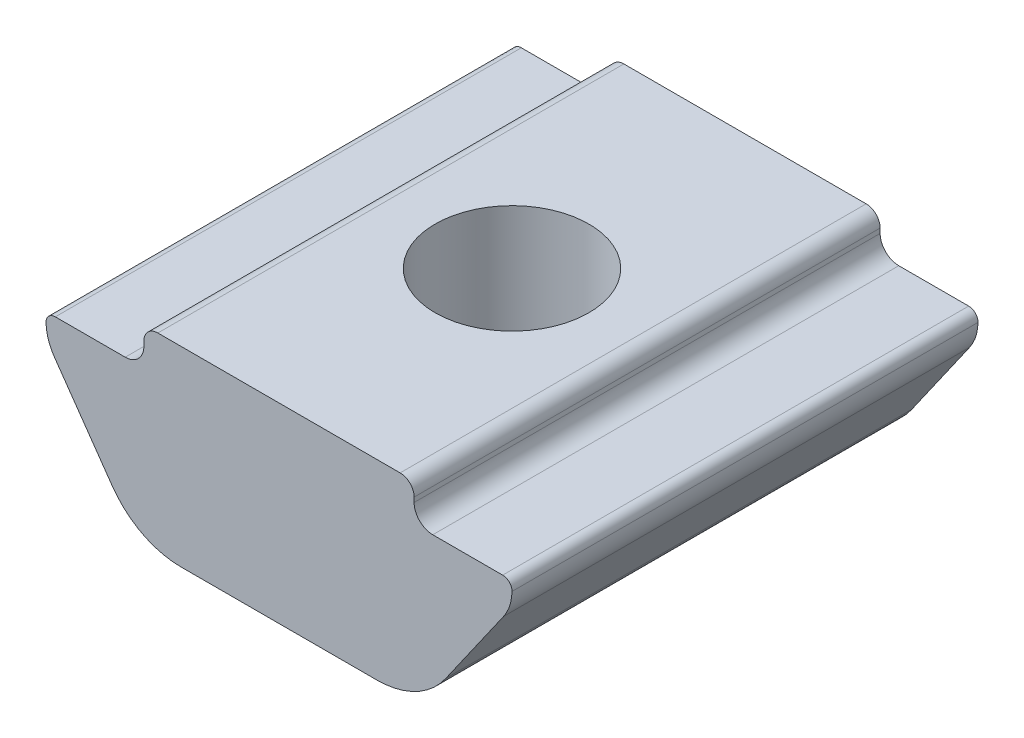
ISO-10303-21;
HEADER;
FILE_DESCRIPTION(('STEP AP214'),'2;1');
FILE_NAME('part.step','',(''),(''),'','','');
FILE_SCHEMA(('AUTOMOTIVE_DESIGN { 1 0 10303 214 1 1 1 1 }'));
ENDSEC;
DATA;
#1=APPLICATION_CONTEXT('core data for automotive mechanical design processes');
#2=APPLICATION_PROTOCOL_DEFINITION('international standard','automotive_design',2000,#1);
#3=PRODUCT_CONTEXT('',#1,'mechanical');
#4=PRODUCT('Part','Part','',(#3));
#5=PRODUCT_RELATED_PRODUCT_CATEGORY('part','',(#4));
#6=PRODUCT_DEFINITION_FORMATION('','',#4);
#7=PRODUCT_DEFINITION_CONTEXT('part definition',#1,'design');
#8=PRODUCT_DEFINITION('design','',#6,#7);
#9=PRODUCT_DEFINITION_SHAPE('','',#8);
#10=(LENGTH_UNIT() NAMED_UNIT(*) SI_UNIT(.MILLI.,.METRE.));
#11=(NAMED_UNIT(*) PLANE_ANGLE_UNIT() SI_UNIT($,.RADIAN.));
#12=(NAMED_UNIT(*) SI_UNIT($,.STERADIAN.) SOLID_ANGLE_UNIT());
#13=UNCERTAINTY_MEASURE_WITH_UNIT(LENGTH_MEASURE(1.E-05),#10,'distance_accuracy_value','');
#14=(GEOMETRIC_REPRESENTATION_CONTEXT(3) GLOBAL_UNCERTAINTY_ASSIGNED_CONTEXT((#13)) GLOBAL_UNIT_ASSIGNED_CONTEXT((#10,
#11,#12)) REPRESENTATION_CONTEXT('',''));
#15=CARTESIAN_POINT('',(0.,0.,0.));
#16=DIRECTION('',(0.,0.,1.));
#17=DIRECTION('',(1.,0.,0.));
#18=AXIS2_PLACEMENT_3D('',#15,#16,#17);
#19=CARTESIAN_POINT('',(-3.29985477037806,-0.399999190001303,5.));
#20=DIRECTION('',(0.,0.,-1.));
#21=DIRECTION('',(-1.,0.,0.));
#22=AXIS2_PLACEMENT_3D('',#19,#20,#21);
#23=CYLINDRICAL_SURFACE('',#22,0.400000009996668);
#24=CARTESIAN_POINT('',(-3.29985477037806,-0.399999190001303,-5.));
#25=DIRECTION('',(0.,0.,-1.));
#26=DIRECTION('',(1.,0.,0.));
#27=AXIS2_PLACEMENT_3D('',#24,#25,#26);
#28=CIRCLE('',#27,0.400000009996668);
#29=CARTESIAN_POINT('',(-2.89985476038472,-0.399999190001303,-5.));
#30=VERTEX_POINT('',#29);
#31=CARTESIAN_POINT('',(-3.29985477037806,-0.799999200001302,-5.));
#32=VERTEX_POINT('',#31);
#33=EDGE_CURVE('E191',#30,#32,#28,.T.);
#34=ORIENTED_EDGE('',*,*,#33,.T.);
#35=DIRECTION('',(0.,0.,-1.));
#36=VECTOR('',#35,1.);
#37=CARTESIAN_POINT('',(-3.29985477037806,-0.799999200001302,5.));
#38=LINE('',#37,#36);
#39=CARTESIAN_POINT('',(-3.29985477037806,-0.799999200001302,5.));
#40=VERTEX_POINT('',#39);
#41=EDGE_CURVE('E11',#40,#32,#38,.T.);
#42=ORIENTED_EDGE('',*,*,#41,.F.);
#43=CARTESIAN_POINT('',(-3.29985477037806,-0.399999190001303,5.));
#44=DIRECTION('',(0.,0.,-1.));
#45=DIRECTION('',(1.,0.,0.));
#46=AXIS2_PLACEMENT_3D('',#43,#44,#45);
#47=CIRCLE('',#46,0.400000009996668);
#48=CARTESIAN_POINT('',(-2.89985476038472,-0.399999190001303,5.));
#49=VERTEX_POINT('',#48);
#50=EDGE_CURVE('E226',#49,#40,#47,.T.);
#51=ORIENTED_EDGE('',*,*,#50,.F.);
#52=DIRECTION('',(0.,0.,-1.));
#53=VECTOR('',#52,1.);
#54=CARTESIAN_POINT('',(-2.89985476038472,-0.399999190001303,5.));
#55=LINE('',#54,#53);
#56=EDGE_CURVE('E187',#49,#30,#55,.T.);
#57=ORIENTED_EDGE('',*,*,#56,.T.);
#58=EDGE_LOOP('',(#34,#42,#51,#57));
#59=FACE_BOUND('',#58,.T.);
#60=ADVANCED_FACE('F35',(#59),#23,.F.);
#61=CARTESIAN_POINT('',(-4.79985654402594,-0.799999200001302,5.));
#62=DIRECTION('',(0.,-1.,0.));
#63=DIRECTION('',(0.,0.,-1.));
#64=AXIS2_PLACEMENT_3D('',#61,#62,#63);
#65=PLANE('',#64);
#66=DIRECTION('',(-1.,0.,0.));
#67=VECTOR('',#66,1.);
#68=CARTESIAN_POINT('',(-4.79985654402594,-0.799999200001302,-5.));
#69=LINE('',#68,#67);
#70=CARTESIAN_POINT('',(-4.79985654402594,-0.799999200001302,-5.));
#71=VERTEX_POINT('',#70);
#72=EDGE_CURVE('E194',#32,#71,#69,.T.);
#73=ORIENTED_EDGE('',*,*,#72,.T.);
#74=DIRECTION('',(0.,0.,-1.));
#75=VECTOR('',#74,1.);
#76=CARTESIAN_POINT('',(-4.79985654402594,-0.799999200001302,5.));
#77=LINE('',#76,#75);
#78=CARTESIAN_POINT('',(-4.79985654402594,-0.799999200001302,5.));
#79=VERTEX_POINT('',#78);
#80=EDGE_CURVE('E43',#79,#71,#77,.T.);
#81=ORIENTED_EDGE('',*,*,#80,.F.);
#82=DIRECTION('',(-1.,0.,0.));
#83=VECTOR('',#82,1.);
#84=CARTESIAN_POINT('',(-4.79985654402594,-0.799999200001302,5.));
#85=LINE('',#84,#83);
#86=EDGE_CURVE('E124',#40,#79,#85,.T.);
#87=ORIENTED_EDGE('',*,*,#86,.F.);
#88=ORIENTED_EDGE('',*,*,#41,.T.);
#89=EDGE_LOOP('',(#73,#81,#87,#88));
#90=FACE_BOUND('',#89,.T.);
#91=ADVANCED_FACE('F334',(#90),#65,.F.);
#92=CARTESIAN_POINT('',(-4.79985654402594,-0.999999200001302,5.));
#93=DIRECTION('',(0.,0.,-1.));
#94=DIRECTION('',(-1.,0.,0.));
#95=AXIS2_PLACEMENT_3D('',#92,#93,#94);
#96=CYLINDRICAL_SURFACE('',#95,0.2);
#97=CARTESIAN_POINT('',(-4.79985654402594,-0.999999200001302,-5.));
#98=DIRECTION('',(0.,0.,1.));
#99=DIRECTION('',(1.,0.,0.));
#100=AXIS2_PLACEMENT_3D('',#97,#98,#99);
#101=CIRCLE('',#100,0.2);
#102=CARTESIAN_POINT('',(-4.99982029290239,-1.00380697300828,-5.));
#103=VERTEX_POINT('',#102);
#104=EDGE_CURVE('E197',#71,#103,#101,.T.);
#105=ORIENTED_EDGE('',*,*,#104,.T.);
#106=DIRECTION('',(0.,0.,-1.));
#107=VECTOR('',#106,1.);
#108=CARTESIAN_POINT('',(-4.99982029290239,-1.00380697300828,5.));
#109=LINE('',#108,#107);
#110=CARTESIAN_POINT('',(-4.99982029290239,-1.00380697300828,5.));
#111=VERTEX_POINT('',#110);
#112=EDGE_CURVE('E263',#111,#103,#109,.T.);
#113=ORIENTED_EDGE('',*,*,#112,.F.);
#114=CARTESIAN_POINT('',(-4.79985654402594,-0.999999200001302,5.));
#115=DIRECTION('',(0.,0.,1.));
#116=DIRECTION('',(1.,0.,0.));
#117=AXIS2_PLACEMENT_3D('',#114,#115,#116);
#118=CIRCLE('',#117,0.2);
#119=EDGE_CURVE('E271',#79,#111,#118,.T.);
#120=ORIENTED_EDGE('',*,*,#119,.F.);
#121=ORIENTED_EDGE('',*,*,#80,.T.);
#122=EDGE_LOOP('',(#105,#113,#120,#121));
#123=FACE_BOUND('',#122,.T.);
#124=ADVANCED_FACE('F269',(#123),#96,.T.);
#125=CARTESIAN_POINT('',(-4.0000015485201,-0.984768107973411,5.));
#126=DIRECTION('',(0.,0.,-1.));
#127=DIRECTION('',(-1.,0.,0.));
#128=AXIS2_PLACEMENT_3D('',#125,#126,#127);
#129=CYLINDRICAL_SURFACE('',#128,0.999999999999998);
#130=CARTESIAN_POINT('',(-4.0000015485201,-0.984768107973411,-5.));
#131=DIRECTION('',(0.,0.,1.));
#132=DIRECTION('',(1.,0.,0.));
#133=AXIS2_PLACEMENT_3D('',#130,#131,#132);
#134=CIRCLE('',#133,0.999999999999998);
#135=CARTESIAN_POINT('',(-4.81923326401881,-1.55823074522281,-5.));
#136=VERTEX_POINT('',#135);
#137=EDGE_CURVE('E199',#103,#136,#134,.T.);
#138=ORIENTED_EDGE('',*,*,#137,.T.);
#139=DIRECTION('',(0.,0.,-1.));
#140=VECTOR('',#139,1.);
#141=CARTESIAN_POINT('',(-4.81923326401881,-1.55823074522281,5.));
#142=LINE('',#141,#140);
#143=CARTESIAN_POINT('',(-4.81923326401881,-1.55823074522281,5.));
#144=VERTEX_POINT('',#143);
#145=EDGE_CURVE('E260',#144,#136,#142,.T.);
#146=ORIENTED_EDGE('',*,*,#145,.F.);
#147=CARTESIAN_POINT('',(-4.0000015485201,-0.984768107973411,5.));
#148=DIRECTION('',(0.,0.,1.));
#149=DIRECTION('',(1.,0.,0.));
#150=AXIS2_PLACEMENT_3D('',#147,#148,#149);
#151=CIRCLE('',#150,0.999999999999998);
#152=EDGE_CURVE('E289',#111,#144,#151,.T.);
#153=ORIENTED_EDGE('',*,*,#152,.F.);
#154=ORIENTED_EDGE('',*,*,#112,.T.);
#155=EDGE_LOOP('',(#138,#146,#153,#154));
#156=FACE_BOUND('',#155,.T.);
#157=ADVANCED_FACE('F280',(#156),#129,.T.);
#158=CARTESIAN_POINT('',(-4.81923326401881,-1.55823074522281,5.));
#159=DIRECTION('',(0.819231715498716,0.573462637249395,0.));
#160=DIRECTION('',(-0.573462637249395,0.819231715498716,0.));
#161=AXIS2_PLACEMENT_3D('',#158,#159,#160);
#162=PLANE('',#161);
#163=DIRECTION('',(0.573462637249395,-0.819231715498716,0.));
#164=VECTOR('',#163,1.);
#165=CARTESIAN_POINT('',(-4.81923326401881,-1.55823074522281,-5.));
#166=LINE('',#165,#164);
#167=CARTESIAN_POINT('',(-3.5774301070642,-3.33223390515531,-5.));
#168=VERTEX_POINT('',#167);
#169=EDGE_CURVE('E201',#136,#168,#166,.T.);
#170=ORIENTED_EDGE('',*,*,#169,.T.);
#171=DIRECTION('',(0.,0.,-1.));
#172=VECTOR('',#171,1.);
#173=CARTESIAN_POINT('',(-3.5774301070642,-3.33223390515531,5.));
#174=LINE('',#173,#172);
#175=CARTESIAN_POINT('',(-3.5774301070642,-3.33223390515531,5.));
#176=VERTEX_POINT('',#175);
#177=EDGE_CURVE('E257',#176,#168,#174,.T.);
#178=ORIENTED_EDGE('',*,*,#177,.F.);
#179=DIRECTION('',(0.573462637249395,-0.819231715498716,0.));
#180=VECTOR('',#179,1.);
#181=CARTESIAN_POINT('',(-4.81923326401881,-1.55823074522281,5.));
#182=LINE('',#181,#180);
#183=EDGE_CURVE('E286',#144,#176,#182,.T.);
#184=ORIENTED_EDGE('',*,*,#183,.F.);
#185=ORIENTED_EDGE('',*,*,#145,.T.);
#186=EDGE_LOOP('',(#170,#178,#184,#185));
#187=FACE_BOUND('',#186,.T.);
#188=ADVANCED_FACE('F284',(#187),#162,.F.);
#189=CARTESIAN_POINT('',(-2.10281301916651,-2.3000011581064,5.));
#190=DIRECTION('',(0.,0.,-1.));
#191=DIRECTION('',(-1.,0.,0.));
#192=AXIS2_PLACEMENT_3D('',#189,#190,#191);
#193=CYLINDRICAL_SURFACE('',#192,1.8);
#194=CARTESIAN_POINT('',(-2.10281301916651,-2.3000011581064,-5.));
#195=DIRECTION('',(0.,0.,1.));
#196=DIRECTION('',(1.,0.,0.));
#197=AXIS2_PLACEMENT_3D('',#194,#195,#196);
#198=CIRCLE('',#197,1.8);
#199=CARTESIAN_POINT('',(-2.10281301916651,-4.1000011581064,-5.));
#200=VERTEX_POINT('',#199);
#201=EDGE_CURVE('E203',#168,#200,#198,.T.);
#202=ORIENTED_EDGE('',*,*,#201,.T.);
#203=DIRECTION('',(0.,0.,-1.));
#204=VECTOR('',#203,1.);
#205=CARTESIAN_POINT('',(-2.10281301916651,-4.1000011581064,5.));
#206=LINE('',#205,#204);
#207=CARTESIAN_POINT('',(-2.10281301916651,-4.1000011581064,5.));
#208=VERTEX_POINT('',#207);
#209=EDGE_CURVE('E254',#208,#200,#206,.T.);
#210=ORIENTED_EDGE('',*,*,#209,.F.);
#211=CARTESIAN_POINT('',(-2.10281301916651,-2.3000011581064,5.));
#212=DIRECTION('',(0.,0.,1.));
#213=DIRECTION('',(1.,0.,0.));
#214=AXIS2_PLACEMENT_3D('',#211,#212,#213);
#215=CIRCLE('',#214,1.8);
#216=EDGE_CURVE('E288',#176,#208,#215,.T.);
#217=ORIENTED_EDGE('',*,*,#216,.F.);
#218=ORIENTED_EDGE('',*,*,#177,.T.);
#219=EDGE_LOOP('',(#202,#210,#217,#218));
#220=FACE_BOUND('',#219,.T.);
#221=ADVANCED_FACE('F347',(#220),#193,.T.);
#222=CARTESIAN_POINT('',(-2.10281301916651,-4.1000011581064,5.));
#223=DIRECTION('',(0.,1.,0.));
#224=DIRECTION('',(-1.,0.,0.));
#225=AXIS2_PLACEMENT_3D('',#222,#223,#224);
#226=PLANE('',#225);
#227=CARTESIAN_POINT('',(0.,-4.1000011581064,0.));
#228=DIRECTION('',(0.,1.,0.));
#229=DIRECTION('',(0.,0.,1.));
#230=AXIS2_PLACEMENT_3D('',#227,#228,#229);
#231=CIRCLE('',#230,1.65);
#232=CARTESIAN_POINT('',(0.,-4.1000011581064,1.65));
#233=VERTEX_POINT('',#232);
#234=EDGE_CURVE('E390',#233,#233,#231,.T.);
#235=ORIENTED_EDGE('',*,*,#234,.T.);
#236=EDGE_LOOP('',(#235));
#237=FACE_BOUND('',#236,.T.);
#238=DIRECTION('',(1.,0.,0.));
#239=VECTOR('',#238,1.);
#240=CARTESIAN_POINT('',(-2.10281301916651,-4.1000011581064,-5.));
#241=LINE('',#240,#239);
#242=CARTESIAN_POINT('',(2.10281301916651,-4.1000011581064,-5.));
#243=VERTEX_POINT('',#242);
#244=EDGE_CURVE('E205',#200,#243,#241,.T.);
#245=ORIENTED_EDGE('',*,*,#244,.T.);
#246=DIRECTION('',(0.,0.,-1.));
#247=VECTOR('',#246,1.);
#248=CARTESIAN_POINT('',(2.10281301916651,-4.1000011581064,5.));
#249=LINE('',#248,#247);
#250=CARTESIAN_POINT('',(2.10281301916651,-4.1000011581064,5.));
#251=VERTEX_POINT('',#250);
#252=EDGE_CURVE('E251',#251,#243,#249,.T.);
#253=ORIENTED_EDGE('',*,*,#252,.F.);
#254=DIRECTION('',(1.,0.,0.));
#255=VECTOR('',#254,1.);
#256=CARTESIAN_POINT('',(-2.10281301916651,-4.1000011581064,5.));
#257=LINE('',#256,#255);
#258=EDGE_CURVE('E291',#208,#251,#257,.T.);
#259=ORIENTED_EDGE('',*,*,#258,.F.);
#260=ORIENTED_EDGE('',*,*,#209,.T.);
#261=EDGE_LOOP('',(#245,#253,#259,#260));
#262=FACE_BOUND('',#261,.T.);
#263=ADVANCED_FACE('F350',(#237,#262),#226,.F.);
#264=CARTESIAN_POINT('',(2.10281301916651,-2.3000011581064,5.));
#265=DIRECTION('',(0.,0.,-1.));
#266=DIRECTION('',(-1.,0.,0.));
#267=AXIS2_PLACEMENT_3D('',#264,#265,#266);
#268=CYLINDRICAL_SURFACE('',#267,1.8);
#269=CARTESIAN_POINT('',(2.10281301916651,-2.3000011581064,-5.));
#270=DIRECTION('',(0.,0.,1.));
#271=DIRECTION('',(-1.,0.,0.));
#272=AXIS2_PLACEMENT_3D('',#269,#270,#271);
#273=CIRCLE('',#272,1.8);
#274=CARTESIAN_POINT('',(3.5774301070642,-3.33223390515531,-5.));
#275=VERTEX_POINT('',#274);
#276=EDGE_CURVE('E207',#243,#275,#273,.T.);
#277=ORIENTED_EDGE('',*,*,#276,.T.);
#278=DIRECTION('',(0.,0.,-1.));
#279=VECTOR('',#278,1.);
#280=CARTESIAN_POINT('',(3.5774301070642,-3.33223390515531,5.));
#281=LINE('',#280,#279);
#282=CARTESIAN_POINT('',(3.5774301070642,-3.33223390515531,5.));
#283=VERTEX_POINT('',#282);
#284=EDGE_CURVE('E248',#283,#275,#281,.T.);
#285=ORIENTED_EDGE('',*,*,#284,.F.);
#286=CARTESIAN_POINT('',(2.10281301916651,-2.3000011581064,5.));
#287=DIRECTION('',(0.,0.,1.));
#288=DIRECTION('',(-1.,0.,0.));
#289=AXIS2_PLACEMENT_3D('',#286,#287,#288);
#290=CIRCLE('',#289,1.8);
#291=EDGE_CURVE('E297',#251,#283,#290,.T.);
#292=ORIENTED_EDGE('',*,*,#291,.F.);
#293=ORIENTED_EDGE('',*,*,#252,.T.);
#294=EDGE_LOOP('',(#277,#285,#292,#293));
#295=FACE_BOUND('',#294,.T.);
#296=ADVANCED_FACE('F354',(#295),#268,.T.);
#297=CARTESIAN_POINT('',(4.81923326401882,-1.55823074522281,5.));
#298=DIRECTION('',(-0.819231715498715,0.573462637249396,0.));
#299=DIRECTION('',(-0.573462637249396,-0.819231715498715,0.));
#300=AXIS2_PLACEMENT_3D('',#297,#298,#299);
#301=PLANE('',#300);
#302=DIRECTION('',(0.573462637249396,0.819231715498715,0.));
#303=VECTOR('',#302,1.);
#304=CARTESIAN_POINT('',(4.81923326401882,-1.55823074522281,-5.));
#305=LINE('',#304,#303);
#306=CARTESIAN_POINT('',(4.81923326401882,-1.55823074522281,-5.));
#307=VERTEX_POINT('',#306);
#308=EDGE_CURVE('E209',#275,#307,#305,.T.);
#309=ORIENTED_EDGE('',*,*,#308,.T.);
#310=DIRECTION('',(0.,0.,-1.));
#311=VECTOR('',#310,1.);
#312=CARTESIAN_POINT('',(4.81923326401882,-1.55823074522281,5.));
#313=LINE('',#312,#311);
#314=CARTESIAN_POINT('',(4.81923326401882,-1.55823074522281,5.));
#315=VERTEX_POINT('',#314);
#316=EDGE_CURVE('E245',#315,#307,#313,.T.);
#317=ORIENTED_EDGE('',*,*,#316,.F.);
#318=DIRECTION('',(0.573462637249396,0.819231715498715,0.));
#319=VECTOR('',#318,1.);
#320=CARTESIAN_POINT('',(4.81923326401882,-1.55823074522281,5.));
#321=LINE('',#320,#319);
#322=EDGE_CURVE('E299',#283,#315,#321,.T.);
#323=ORIENTED_EDGE('',*,*,#322,.F.);
#324=ORIENTED_EDGE('',*,*,#284,.T.);
#325=EDGE_LOOP('',(#309,#317,#323,#324));
#326=FACE_BOUND('',#325,.T.);
#327=ADVANCED_FACE('F358',(#326),#301,.F.);
#328=CARTESIAN_POINT('',(4.0000015485201,-0.98476810797341,5.));
#329=DIRECTION('',(0.,0.,-1.));
#330=DIRECTION('',(-1.,0.,0.));
#331=AXIS2_PLACEMENT_3D('',#328,#329,#330);
#332=CYLINDRICAL_SURFACE('',#331,1.);
#333=CARTESIAN_POINT('',(4.0000015485201,-0.98476810797341,-5.));
#334=DIRECTION('',(0.,0.,1.));
#335=DIRECTION('',(-1.,0.,0.));
#336=AXIS2_PLACEMENT_3D('',#333,#334,#335);
#337=CIRCLE('',#336,1.);
#338=CARTESIAN_POINT('',(4.99982029290239,-1.00380697300827,-5.));
#339=VERTEX_POINT('',#338);
#340=EDGE_CURVE('E211',#307,#339,#337,.T.);
#341=ORIENTED_EDGE('',*,*,#340,.T.);
#342=DIRECTION('',(0.,0.,-1.));
#343=VECTOR('',#342,1.);
#344=CARTESIAN_POINT('',(4.99982029290239,-1.00380697300827,5.));
#345=LINE('',#344,#343);
#346=CARTESIAN_POINT('',(4.99982029290239,-1.00380697300827,5.));
#347=VERTEX_POINT('',#346);
#348=EDGE_CURVE('E242',#347,#339,#345,.T.);
#349=ORIENTED_EDGE('',*,*,#348,.F.);
#350=CARTESIAN_POINT('',(4.0000015485201,-0.98476810797341,5.));
#351=DIRECTION('',(0.,0.,1.));
#352=DIRECTION('',(-1.,0.,0.));
#353=AXIS2_PLACEMENT_3D('',#350,#351,#352);
#354=CIRCLE('',#353,1.);
#355=EDGE_CURVE('E301',#315,#347,#354,.T.);
#356=ORIENTED_EDGE('',*,*,#355,.F.);
#357=ORIENTED_EDGE('',*,*,#316,.T.);
#358=EDGE_LOOP('',(#341,#349,#356,#357));
#359=FACE_BOUND('',#358,.T.);
#360=ADVANCED_FACE('F362',(#359),#332,.T.);
#361=CARTESIAN_POINT('',(4.79985654402594,-0.999999200001301,5.));
#362=DIRECTION('',(0.,0.,-1.));
#363=DIRECTION('',(-1.,0.,0.));
#364=AXIS2_PLACEMENT_3D('',#361,#362,#363);
#365=CYLINDRICAL_SURFACE('',#364,0.2);
#366=CARTESIAN_POINT('',(4.79985654402594,-0.999999200001301,-5.));
#367=DIRECTION('',(0.,0.,1.));
#368=DIRECTION('',(-1.,0.,0.));
#369=AXIS2_PLACEMENT_3D('',#366,#367,#368);
#370=CIRCLE('',#369,0.2);
#371=CARTESIAN_POINT('',(4.79985654402594,-0.799999200001301,-5.));
#372=VERTEX_POINT('',#371);
#373=EDGE_CURVE('E213',#339,#372,#370,.T.);
#374=ORIENTED_EDGE('',*,*,#373,.T.);
#375=DIRECTION('',(0.,0.,-1.));
#376=VECTOR('',#375,1.);
#377=CARTESIAN_POINT('',(4.79985654402594,-0.799999200001301,5.));
#378=LINE('',#377,#376);
#379=CARTESIAN_POINT('',(4.79985654402594,-0.799999200001301,5.));
#380=VERTEX_POINT('',#379);
#381=EDGE_CURVE('E239',#380,#372,#378,.T.);
#382=ORIENTED_EDGE('',*,*,#381,.F.);
#383=CARTESIAN_POINT('',(4.79985654402594,-0.999999200001301,5.));
#384=DIRECTION('',(0.,0.,1.));
#385=DIRECTION('',(-1.,0.,0.));
#386=AXIS2_PLACEMENT_3D('',#383,#384,#385);
#387=CIRCLE('',#386,0.2);
#388=EDGE_CURVE('E303',#347,#380,#387,.T.);
#389=ORIENTED_EDGE('',*,*,#388,.F.);
#390=ORIENTED_EDGE('',*,*,#348,.T.);
#391=EDGE_LOOP('',(#374,#382,#389,#390));
#392=FACE_BOUND('',#391,.T.);
#393=ADVANCED_FACE('F366',(#392),#365,.T.);
#394=CARTESIAN_POINT('',(4.79985654402594,-0.799999200001301,5.));
#395=DIRECTION('',(0.,-1.,0.));
#396=DIRECTION('',(1.,0.,0.));
#397=AXIS2_PLACEMENT_3D('',#394,#395,#396);
#398=PLANE('',#397);
#399=DIRECTION('',(-1.,0.,0.));
#400=VECTOR('',#399,1.);
#401=CARTESIAN_POINT('',(4.79985654402594,-0.799999200001301,-5.));
#402=LINE('',#401,#400);
#403=CARTESIAN_POINT('',(3.29985477037806,-0.799999200001302,-5.));
#404=VERTEX_POINT('',#403);
#405=EDGE_CURVE('E215',#372,#404,#402,.T.);
#406=ORIENTED_EDGE('',*,*,#405,.T.);
#407=DIRECTION('',(0.,0.,-1.));
#408=VECTOR('',#407,1.);
#409=CARTESIAN_POINT('',(3.29985477037806,-0.799999200001302,5.));
#410=LINE('',#409,#408);
#411=CARTESIAN_POINT('',(3.29985477037806,-0.799999200001302,5.));
#412=VERTEX_POINT('',#411);
#413=EDGE_CURVE('E236',#412,#404,#410,.T.);
#414=ORIENTED_EDGE('',*,*,#413,.F.);
#415=DIRECTION('',(-1.,0.,0.));
#416=VECTOR('',#415,1.);
#417=CARTESIAN_POINT('',(4.79985654402594,-0.799999200001301,5.));
#418=LINE('',#417,#416);
#419=EDGE_CURVE('E305',#380,#412,#418,.T.);
#420=ORIENTED_EDGE('',*,*,#419,.F.);
#421=ORIENTED_EDGE('',*,*,#381,.T.);
#422=EDGE_LOOP('',(#406,#414,#420,#421));
#423=FACE_BOUND('',#422,.T.);
#424=ADVANCED_FACE('F370',(#423),#398,.F.);
#425=CARTESIAN_POINT('',(3.29985477037806,-0.399999190001302,5.));
#426=DIRECTION('',(0.,0.,-1.));
#427=DIRECTION('',(-1.,0.,0.));
#428=AXIS2_PLACEMENT_3D('',#425,#426,#427);
#429=CYLINDRICAL_SURFACE('',#428,0.400000009996668);
#430=CARTESIAN_POINT('',(3.29985477037806,-0.399999190001302,-5.));
#431=DIRECTION('',(0.,0.,-1.));
#432=DIRECTION('',(-1.,0.,0.));
#433=AXIS2_PLACEMENT_3D('',#430,#431,#432);
#434=CIRCLE('',#433,0.400000009996668);
#435=CARTESIAN_POINT('',(2.89985476038139,-0.399999190001302,-5.));
#436=VERTEX_POINT('',#435);
#437=EDGE_CURVE('E217',#404,#436,#434,.T.);
#438=ORIENTED_EDGE('',*,*,#437,.T.);
#439=DIRECTION('',(0.,0.,-1.));
#440=VECTOR('',#439,1.);
#441=CARTESIAN_POINT('',(2.89985476038139,-0.399999190001302,5.));
#442=LINE('',#441,#440);
#443=CARTESIAN_POINT('',(2.89985476038139,-0.399999190001302,5.));
#444=VERTEX_POINT('',#443);
#445=EDGE_CURVE('E233',#444,#436,#442,.T.);
#446=ORIENTED_EDGE('',*,*,#445,.F.);
#447=CARTESIAN_POINT('',(3.29985477037806,-0.399999190001302,5.));
#448=DIRECTION('',(0.,0.,-1.));
#449=DIRECTION('',(-1.,0.,0.));
#450=AXIS2_PLACEMENT_3D('',#447,#448,#449);
#451=CIRCLE('',#450,0.400000009996668);
#452=EDGE_CURVE('E307',#412,#444,#451,.T.);
#453=ORIENTED_EDGE('',*,*,#452,.F.);
#454=ORIENTED_EDGE('',*,*,#413,.T.);
#455=EDGE_LOOP('',(#438,#446,#453,#454));
#456=FACE_BOUND('',#455,.T.);
#457=ADVANCED_FACE('F374',(#456),#429,.F.);
#458=CARTESIAN_POINT('',(2.89985476038472,-0.300000009999999,5.));
#459=DIRECTION('',(-1.,0.,0.));
#460=DIRECTION('',(0.,0.,1.));
#461=AXIS2_PLACEMENT_3D('',#458,#459,#460);
#462=PLANE('',#461);
#463=DIRECTION('',(0.,1.,0.));
#464=VECTOR('',#463,1.);
#465=CARTESIAN_POINT('',(2.89985476038472,-0.300000009999999,-5.));
#466=LINE('',#465,#464);
#467=CARTESIAN_POINT('',(2.89985476038472,-0.300000009999999,-5.));
#468=VERTEX_POINT('',#467);
#469=EDGE_CURVE('E219',#436,#468,#466,.T.);
#470=ORIENTED_EDGE('',*,*,#469,.T.);
#471=DIRECTION('',(0.,0.,-1.));
#472=VECTOR('',#471,1.);
#473=CARTESIAN_POINT('',(2.89985476038472,-0.300000009999999,5.));
#474=LINE('',#473,#472);
#475=CARTESIAN_POINT('',(2.89985476038472,-0.300000009999999,5.));
#476=VERTEX_POINT('',#475);
#477=EDGE_CURVE('E230',#476,#468,#474,.T.);
#478=ORIENTED_EDGE('',*,*,#477,.F.);
#479=DIRECTION('',(0.,1.,0.));
#480=VECTOR('',#479,1.);
#481=CARTESIAN_POINT('',(2.89985476038472,-0.300000009999999,5.));
#482=LINE('',#481,#480);
#483=EDGE_CURVE('E309',#444,#476,#482,.T.);
#484=ORIENTED_EDGE('',*,*,#483,.F.);
#485=ORIENTED_EDGE('',*,*,#445,.T.);
#486=EDGE_LOOP('',(#470,#478,#484,#485));
#487=FACE_BOUND('',#486,.T.);
#488=ADVANCED_FACE('F315',(#487),#462,.F.);
#489=CARTESIAN_POINT('',(2.59985475038472,-0.300000009999999,5.));
#490=DIRECTION('',(0.,0.,-1.));
#491=DIRECTION('',(-1.,0.,0.));
#492=AXIS2_PLACEMENT_3D('',#489,#490,#491);
#493=CYLINDRICAL_SURFACE('',#492,0.300000009999999);
#494=CARTESIAN_POINT('',(2.59985475038472,-0.300000009999999,-5.));
#495=DIRECTION('',(0.,0.,1.));
#496=DIRECTION('',(-1.,0.,0.));
#497=AXIS2_PLACEMENT_3D('',#494,#495,#496);
#498=CIRCLE('',#497,0.300000009999999);
#499=CARTESIAN_POINT('',(2.59985475038472,0.,-5.));
#500=VERTEX_POINT('',#499);
#501=EDGE_CURVE('E221',#468,#500,#498,.T.);
#502=ORIENTED_EDGE('',*,*,#501,.T.);
#503=DIRECTION('',(0.,0.,-1.));
#504=VECTOR('',#503,1.);
#505=CARTESIAN_POINT('',(2.59985475038472,0.,5.));
#506=LINE('',#505,#504);
#507=CARTESIAN_POINT('',(2.59985475038472,0.,5.));
#508=VERTEX_POINT('',#507);
#509=EDGE_CURVE('E182',#508,#500,#506,.T.);
#510=ORIENTED_EDGE('',*,*,#509,.F.);
#511=CARTESIAN_POINT('',(2.59985475038472,-0.300000009999999,5.));
#512=DIRECTION('',(0.,0.,1.));
#513=DIRECTION('',(-1.,0.,0.));
#514=AXIS2_PLACEMENT_3D('',#511,#512,#513);
#515=CIRCLE('',#514,0.300000009999999);
#516=EDGE_CURVE('E173',#476,#508,#515,.T.);
#517=ORIENTED_EDGE('',*,*,#516,.F.);
#518=ORIENTED_EDGE('',*,*,#477,.T.);
#519=EDGE_LOOP('',(#502,#510,#517,#518));
#520=FACE_BOUND('',#519,.T.);
#521=ADVANCED_FACE('F319',(#520),#493,.T.);
#522=CARTESIAN_POINT('',(-2.59985475038472,0.,5.));
#523=DIRECTION('',(0.,-1.,0.));
#524=DIRECTION('',(1.,0.,0.));
#525=AXIS2_PLACEMENT_3D('',#522,#523,#524);
#526=PLANE('',#525);
#527=CARTESIAN_POINT('',(0.,0.,0.));
#528=DIRECTION('',(0.,1.,0.));
#529=DIRECTION('',(0.,0.,1.));
#530=AXIS2_PLACEMENT_3D('',#527,#528,#529);
#531=CIRCLE('',#530,1.65);
#532=CARTESIAN_POINT('',(0.,0.,1.65));
#533=VERTEX_POINT('',#532);
#534=EDGE_CURVE('E195',#533,#533,#531,.T.);
#535=ORIENTED_EDGE('',*,*,#534,.F.);
#536=EDGE_LOOP('',(#535));
#537=FACE_BOUND('',#536,.T.);
#538=DIRECTION('',(-1.,0.,0.));
#539=VECTOR('',#538,1.);
#540=CARTESIAN_POINT('',(-2.59985475038472,0.,-5.));
#541=LINE('',#540,#539);
#542=CARTESIAN_POINT('',(-2.59985475038472,0.,-5.));
#543=VERTEX_POINT('',#542);
#544=EDGE_CURVE('E181',#500,#543,#541,.T.);
#545=ORIENTED_EDGE('',*,*,#544,.T.);
#546=DIRECTION('',(0.,0.,-1.));
#547=VECTOR('',#546,1.);
#548=CARTESIAN_POINT('',(-2.59985475038472,0.,5.));
#549=LINE('',#548,#547);
#550=CARTESIAN_POINT('',(-2.59985475038472,0.,5.));
#551=VERTEX_POINT('',#550);
#552=EDGE_CURVE('E178',#551,#543,#549,.T.);
#553=ORIENTED_EDGE('',*,*,#552,.F.);
#554=DIRECTION('',(-1.,0.,0.));
#555=VECTOR('',#554,1.);
#556=CARTESIAN_POINT('',(-2.59985475038472,0.,5.));
#557=LINE('',#556,#555);
#558=EDGE_CURVE('E167',#508,#551,#557,.T.);
#559=ORIENTED_EDGE('',*,*,#558,.F.);
#560=ORIENTED_EDGE('',*,*,#509,.T.);
#561=EDGE_LOOP('',(#545,#553,#559,#560));
#562=FACE_BOUND('',#561,.T.);
#563=ADVANCED_FACE('F179',(#537,#562),#526,.F.);
#564=CARTESIAN_POINT('',(-2.59985475038472,-0.30000001,5.));
#565=DIRECTION('',(0.,0.,-1.));
#566=DIRECTION('',(-1.,0.,0.));
#567=AXIS2_PLACEMENT_3D('',#564,#565,#566);
#568=CYLINDRICAL_SURFACE('',#567,0.300000009999999);
#569=CARTESIAN_POINT('',(-2.59985475038472,-0.30000001,-5.));
#570=DIRECTION('',(0.,0.,1.));
#571=DIRECTION('',(1.,0.,0.));
#572=AXIS2_PLACEMENT_3D('',#569,#570,#571);
#573=CIRCLE('',#572,0.300000009999999);
#574=CARTESIAN_POINT('',(-2.89985476038472,-0.30000001,-5.));
#575=VERTEX_POINT('',#574);
#576=EDGE_CURVE('E110',#543,#575,#573,.T.);
#577=ORIENTED_EDGE('',*,*,#576,.T.);
#578=DIRECTION('',(0.,0.,-1.));
#579=VECTOR('',#578,1.);
#580=CARTESIAN_POINT('',(-2.89985476038472,-0.30000001,5.));
#581=LINE('',#580,#579);
#582=CARTESIAN_POINT('',(-2.89985476038472,-0.30000001,5.));
#583=VERTEX_POINT('',#582);
#584=EDGE_CURVE('E183',#583,#575,#581,.T.);
#585=ORIENTED_EDGE('',*,*,#584,.F.);
#586=CARTESIAN_POINT('',(-2.59985475038472,-0.30000001,5.));
#587=DIRECTION('',(0.,0.,1.));
#588=DIRECTION('',(1.,0.,0.));
#589=AXIS2_PLACEMENT_3D('',#586,#587,#588);
#590=CIRCLE('',#589,0.300000009999999);
#591=EDGE_CURVE('E171',#551,#583,#590,.T.);
#592=ORIENTED_EDGE('',*,*,#591,.F.);
#593=ORIENTED_EDGE('',*,*,#552,.T.);
#594=EDGE_LOOP('',(#577,#585,#592,#593));
#595=FACE_BOUND('',#594,.T.);
#596=ADVANCED_FACE('F185',(#595),#568,.T.);
#597=CARTESIAN_POINT('',(-2.89985476038472,-0.30000001,5.));
#598=DIRECTION('',(1.,0.,0.));
#599=DIRECTION('',(0.,0.,-1.));
#600=AXIS2_PLACEMENT_3D('',#597,#598,#599);
#601=PLANE('',#600);
#602=DIRECTION('',(0.,-1.,0.));
#603=VECTOR('',#602,1.);
#604=CARTESIAN_POINT('',(-2.89985476038472,-0.30000001,-5.));
#605=LINE('',#604,#603);
#606=EDGE_CURVE('E116',#575,#30,#605,.T.);
#607=ORIENTED_EDGE('',*,*,#606,.T.);
#608=ORIENTED_EDGE('',*,*,#56,.F.);
#609=DIRECTION('',(0.,-1.,0.));
#610=VECTOR('',#609,1.);
#611=CARTESIAN_POINT('',(-2.89985476038472,-0.30000001,5.));
#612=LINE('',#611,#610);
#613=EDGE_CURVE('E51',#583,#49,#612,.T.);
#614=ORIENTED_EDGE('',*,*,#613,.F.);
#615=ORIENTED_EDGE('',*,*,#584,.T.);
#616=EDGE_LOOP('',(#607,#608,#614,#615));
#617=FACE_BOUND('',#616,.T.);
#618=ADVANCED_FACE('F323',(#617),#601,.F.);
#619=CARTESIAN_POINT('',(-3.29985477037806,-0.399999190001303,5.));
#620=DIRECTION('',(0.,0.,1.));
#621=DIRECTION('',(1.,0.,0.));
#622=AXIS2_PLACEMENT_3D('',#619,#620,#621);
#623=PLANE('',#622);
#624=ORIENTED_EDGE('',*,*,#50,.T.);
#625=ORIENTED_EDGE('',*,*,#86,.T.);
#626=ORIENTED_EDGE('',*,*,#119,.T.);
#627=ORIENTED_EDGE('',*,*,#152,.T.);
#628=ORIENTED_EDGE('',*,*,#183,.T.);
#629=ORIENTED_EDGE('',*,*,#216,.T.);
#630=ORIENTED_EDGE('',*,*,#258,.T.);
#631=ORIENTED_EDGE('',*,*,#291,.T.);
#632=ORIENTED_EDGE('',*,*,#322,.T.);
#633=ORIENTED_EDGE('',*,*,#355,.T.);
#634=ORIENTED_EDGE('',*,*,#388,.T.);
#635=ORIENTED_EDGE('',*,*,#419,.T.);
#636=ORIENTED_EDGE('',*,*,#452,.T.);
#637=ORIENTED_EDGE('',*,*,#483,.T.);
#638=ORIENTED_EDGE('',*,*,#516,.T.);
#639=ORIENTED_EDGE('',*,*,#558,.T.);
#640=ORIENTED_EDGE('',*,*,#591,.T.);
#641=ORIENTED_EDGE('',*,*,#613,.T.);
#642=EDGE_LOOP('',(#624,#625,#626,#627,#628,#629,#630,#631,#632,#633,#634,#635,#636,#637,#638,
#639,#640,#641));
#643=FACE_BOUND('',#642,.T.);
#644=ADVANCED_FACE('F169',(#643),#623,.T.);
#645=CARTESIAN_POINT('',(-3.29985477037806,-0.399999190001303,-5.));
#646=DIRECTION('',(0.,0.,1.));
#647=DIRECTION('',(1.,0.,0.));
#648=AXIS2_PLACEMENT_3D('',#645,#646,#647);
#649=PLANE('',#648);
#650=ORIENTED_EDGE('',*,*,#33,.F.);
#651=ORIENTED_EDGE('',*,*,#606,.F.);
#652=ORIENTED_EDGE('',*,*,#576,.F.);
#653=ORIENTED_EDGE('',*,*,#544,.F.);
#654=ORIENTED_EDGE('',*,*,#501,.F.);
#655=ORIENTED_EDGE('',*,*,#469,.F.);
#656=ORIENTED_EDGE('',*,*,#437,.F.);
#657=ORIENTED_EDGE('',*,*,#405,.F.);
#658=ORIENTED_EDGE('',*,*,#373,.F.);
#659=ORIENTED_EDGE('',*,*,#340,.F.);
#660=ORIENTED_EDGE('',*,*,#308,.F.);
#661=ORIENTED_EDGE('',*,*,#276,.F.);
#662=ORIENTED_EDGE('',*,*,#244,.F.);
#663=ORIENTED_EDGE('',*,*,#201,.F.);
#664=ORIENTED_EDGE('',*,*,#169,.F.);
#665=ORIENTED_EDGE('',*,*,#137,.F.);
#666=ORIENTED_EDGE('',*,*,#104,.F.);
#667=ORIENTED_EDGE('',*,*,#72,.F.);
#668=EDGE_LOOP('',(#650,#651,#652,#653,#654,#655,#656,#657,#658,#659,#660,#661,#662,#663,#664,
#665,#666,#667));
#669=FACE_BOUND('',#668,.T.);
#670=ADVANCED_FACE('F275',(#669),#649,.F.);
#671=CARTESIAN_POINT('',(0.,0.,0.));
#672=DIRECTION('',(0.,1.,0.));
#673=DIRECTION('',(0.,0.,1.));
#674=AXIS2_PLACEMENT_3D('',#671,#672,#673);
#675=CYLINDRICAL_SURFACE('',#674,1.65);
#676=ORIENTED_EDGE('',*,*,#234,.F.);
#677=EDGE_LOOP('',(#676));
#678=FACE_BOUND('',#677,.T.);
#679=ORIENTED_EDGE('',*,*,#534,.T.);
#680=EDGE_LOOP('',(#679));
#681=FACE_BOUND('',#680,.T.);
#682=ADVANCED_FACE('F399',(#678,#681),#675,.F.);
#683=CLOSED_SHELL('',(#60,#91,#124,#157,#188,#221,#263,#296,#327,#360,#393,#424,#457,#488,#521,
#563,#596,#618,#644,#670,#682));
#684=MANIFOLD_SOLID_BREP('B2',#683);
#685=ADVANCED_BREP_SHAPE_REPRESENTATION('',(#18,#684),#14);
#686=SHAPE_DEFINITION_REPRESENTATION(#9,#685);
ENDSEC;
END-ISO-10303-21;
